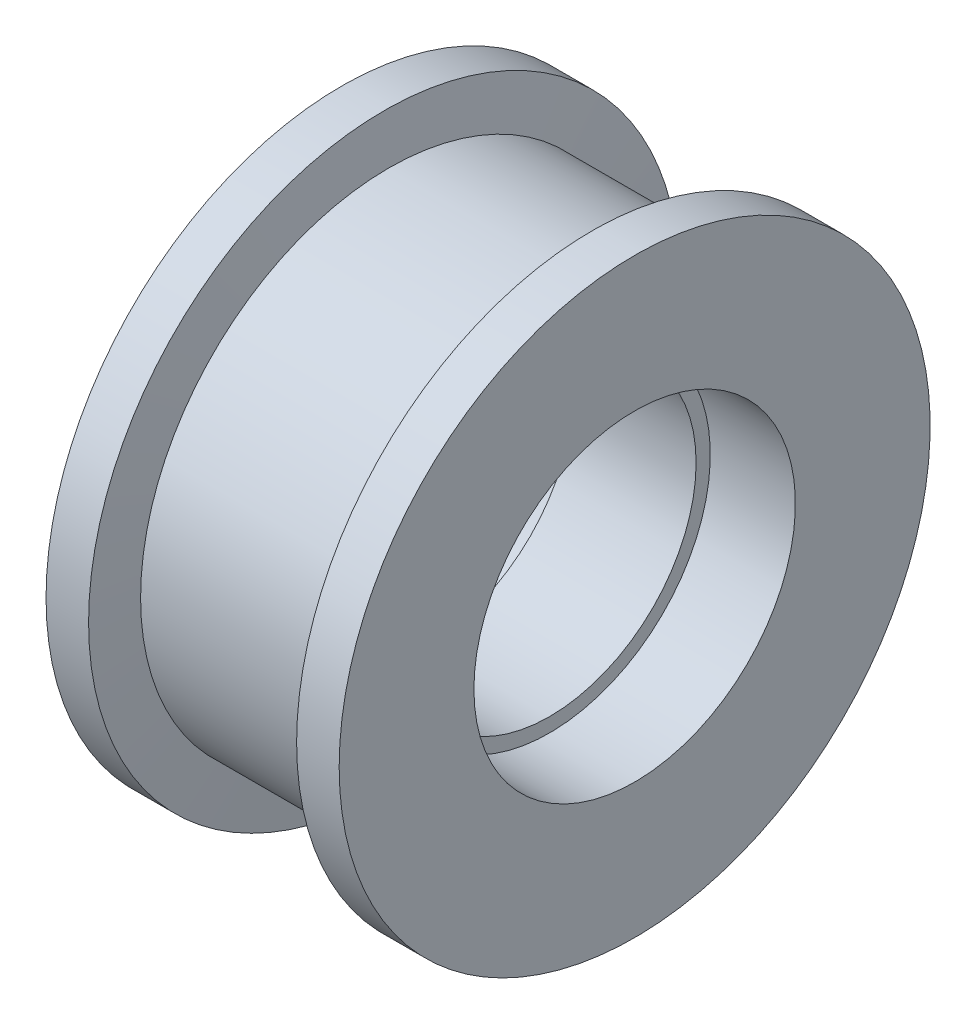
ISO-10303-21;
HEADER;
FILE_DESCRIPTION(('STEP AP214'),'2;1');
FILE_NAME('part.step','',(''),(''),'','','');
FILE_SCHEMA(('AUTOMOTIVE_DESIGN { 1 0 10303 214 1 1 1 1 }'));
ENDSEC;
DATA;
#1=APPLICATION_CONTEXT('core data for automotive mechanical design processes');
#2=APPLICATION_PROTOCOL_DEFINITION('international standard','automotive_design',2000,#1);
#3=PRODUCT_CONTEXT('',#1,'mechanical');
#4=PRODUCT('Part','Part','',(#3));
#5=PRODUCT_RELATED_PRODUCT_CATEGORY('part','',(#4));
#6=PRODUCT_DEFINITION_FORMATION('','',#4);
#7=PRODUCT_DEFINITION_CONTEXT('part definition',#1,'design');
#8=PRODUCT_DEFINITION('design','',#6,#7);
#9=PRODUCT_DEFINITION_SHAPE('','',#8);
#10=(LENGTH_UNIT() NAMED_UNIT(*) SI_UNIT(.MILLI.,.METRE.));
#11=(NAMED_UNIT(*) PLANE_ANGLE_UNIT() SI_UNIT($,.RADIAN.));
#12=(NAMED_UNIT(*) SI_UNIT($,.STERADIAN.) SOLID_ANGLE_UNIT());
#13=UNCERTAINTY_MEASURE_WITH_UNIT(LENGTH_MEASURE(1.E-05),#10,'distance_accuracy_value','');
#14=(GEOMETRIC_REPRESENTATION_CONTEXT(3) GLOBAL_UNCERTAINTY_ASSIGNED_CONTEXT((#13)) GLOBAL_UNIT_ASSIGNED_CONTEXT((#10,
#11,#12)) REPRESENTATION_CONTEXT('',''));
#15=CARTESIAN_POINT('',(0.,0.,0.));
#16=DIRECTION('',(0.,0.,1.));
#17=DIRECTION('',(1.,0.,0.));
#18=AXIS2_PLACEMENT_3D('',#15,#16,#17);
#19=CARTESIAN_POINT('',(-4202.91524097881,0.,7445.48323822232));
#20=DIRECTION('',(-1.,0.,0.));
#21=DIRECTION('',(0.,0.,1.));
#22=AXIS2_PLACEMENT_3D('',#19,#20,#21);
#23=PLANE('',#22);
#24=CARTESIAN_POINT('',(-4202.91524097881,0.,7411.48323822232));
#25=DIRECTION('',(-1.,0.,0.));
#26=DIRECTION('',(0.,0.,1.));
#27=AXIS2_PLACEMENT_3D('',#24,#25,#26);
#28=CIRCLE('',#27,62.5);
#29=CARTESIAN_POINT('',(-4202.91524097881,0.,7473.98323822232));
#30=VERTEX_POINT('',#29);
#31=EDGE_CURVE('E10',#30,#30,#28,.T.);
#32=ORIENTED_EDGE('',*,*,#31,.T.);
#33=EDGE_LOOP('',(#32));
#34=FACE_BOUND('',#33,.T.);
#35=CARTESIAN_POINT('',(-4202.91524097881,0.,7411.48323822232));
#36=DIRECTION('',(-1.,0.,0.));
#37=DIRECTION('',(0.,0.,1.));
#38=AXIS2_PLACEMENT_3D('',#35,#36,#37);
#39=CIRCLE('',#38,33.9999999999998);
#40=CARTESIAN_POINT('',(-4202.91524097881,0.,7445.48323822232));
#41=VERTEX_POINT('',#40);
#42=EDGE_CURVE('E72',#41,#41,#39,.T.);
#43=ORIENTED_EDGE('',*,*,#42,.F.);
#44=EDGE_LOOP('',(#43));
#45=FACE_BOUND('',#44,.T.);
#46=ADVANCED_FACE('F32',(#34,#45),#23,.T.);
#47=CARTESIAN_POINT('',(-4235.17838032797,0.,7411.48323822232));
#48=DIRECTION('',(-1.,0.,0.));
#49=DIRECTION('',(0.,0.,1.));
#50=AXIS2_PLACEMENT_3D('',#47,#48,#49);
#51=CYLINDRICAL_SURFACE('',#50,62.5000000000004);
#52=CARTESIAN_POINT('',(-4193.91524097881,0.,7411.48323822232));
#53=DIRECTION('',(-1.,0.,0.));
#54=DIRECTION('',(0.,0.,1.));
#55=AXIS2_PLACEMENT_3D('',#52,#53,#54);
#56=CIRCLE('',#55,62.5000000000009);
#57=CARTESIAN_POINT('',(-4193.91524097881,0.,7473.98323822232));
#58=VERTEX_POINT('',#57);
#59=EDGE_CURVE('E38',#58,#58,#56,.T.);
#60=ORIENTED_EDGE('',*,*,#59,.T.);
#61=EDGE_LOOP('',(#60));
#62=FACE_BOUND('',#61,.T.);
#63=ORIENTED_EDGE('',*,*,#31,.F.);
#64=EDGE_LOOP('',(#63));
#65=FACE_BOUND('',#64,.T.);
#66=ADVANCED_FACE('F80',(#62,#65),#51,.T.);
#67=CARTESIAN_POINT('',(-4193.91524097881,0.,7411.48323822232));
#68=DIRECTION('',(-1.,0.,0.));
#69=DIRECTION('',(0.,0.,1.));
#70=AXIS2_PLACEMENT_3D('',#67,#68,#69);
#71=CONICAL_SURFACE('',#70,62.5000000000009,1.4711276743038);
#72=CARTESIAN_POINT('',(-4192.91524097881,0.,7411.48323822232));
#73=DIRECTION('',(-1.,0.,0.));
#74=DIRECTION('',(0.,0.,1.));
#75=AXIS2_PLACEMENT_3D('',#72,#73,#74);
#76=CIRCLE('',#75,52.5000000000002);
#77=CARTESIAN_POINT('',(-4192.91524097881,0.,7463.98323822232));
#78=VERTEX_POINT('',#77);
#79=EDGE_CURVE('E42',#78,#78,#76,.T.);
#80=ORIENTED_EDGE('',*,*,#79,.T.);
#81=EDGE_LOOP('',(#80));
#82=FACE_BOUND('',#81,.T.);
#83=ORIENTED_EDGE('',*,*,#59,.F.);
#84=EDGE_LOOP('',(#83));
#85=FACE_BOUND('',#84,.T.);
#86=ADVANCED_FACE('F84',(#82,#85),#71,.T.);
#87=CARTESIAN_POINT('',(-4235.17838032797,0.,7411.48323822232));
#88=DIRECTION('',(-1.,0.,0.));
#89=DIRECTION('',(0.,0.,1.));
#90=AXIS2_PLACEMENT_3D('',#87,#88,#89);
#91=CYLINDRICAL_SURFACE('',#90,52.5000000000007);
#92=CARTESIAN_POINT('',(-4150.91524097881,0.,7411.48323822232));
#93=DIRECTION('',(-1.,0.,0.));
#94=DIRECTION('',(0.,0.,1.));
#95=AXIS2_PLACEMENT_3D('',#92,#93,#94);
#96=CIRCLE('',#95,52.5000000000011);
#97=CARTESIAN_POINT('',(-4150.91524097881,0.,7463.98323822232));
#98=VERTEX_POINT('',#97);
#99=EDGE_CURVE('E46',#98,#98,#96,.T.);
#100=ORIENTED_EDGE('',*,*,#99,.T.);
#101=EDGE_LOOP('',(#100));
#102=FACE_BOUND('',#101,.T.);
#103=ORIENTED_EDGE('',*,*,#79,.F.);
#104=EDGE_LOOP('',(#103));
#105=FACE_BOUND('',#104,.T.);
#106=ADVANCED_FACE('F88',(#102,#105),#91,.T.);
#107=CARTESIAN_POINT('',(-4150.91524097881,0.,7411.48323822232));
#108=DIRECTION('',(1.,0.,0.));
#109=DIRECTION('',(0.,0.,-1.));
#110=AXIS2_PLACEMENT_3D('',#107,#108,#109);
#111=CONICAL_SURFACE('',#110,52.5000000000011,1.47112767430379);
#112=CARTESIAN_POINT('',(-4149.91524097881,0.,7411.48323822232));
#113=DIRECTION('',(-1.,0.,0.));
#114=DIRECTION('',(0.,0.,1.));
#115=AXIS2_PLACEMENT_3D('',#112,#113,#114);
#116=CIRCLE('',#115,62.5000000000009);
#117=CARTESIAN_POINT('',(-4149.91524097881,0.,7473.98323822232));
#118=VERTEX_POINT('',#117);
#119=EDGE_CURVE('E51',#118,#118,#116,.T.);
#120=ORIENTED_EDGE('',*,*,#119,.T.);
#121=EDGE_LOOP('',(#120));
#122=FACE_BOUND('',#121,.T.);
#123=ORIENTED_EDGE('',*,*,#99,.F.);
#124=EDGE_LOOP('',(#123));
#125=FACE_BOUND('',#124,.T.);
#126=ADVANCED_FACE('F95',(#122,#125),#111,.T.);
#127=CARTESIAN_POINT('',(-4235.17838032797,0.,7411.48323822232));
#128=DIRECTION('',(-1.,0.,0.));
#129=DIRECTION('',(0.,0.,1.));
#130=AXIS2_PLACEMENT_3D('',#127,#128,#129);
#131=CYLINDRICAL_SURFACE('',#130,62.5000000000004);
#132=CARTESIAN_POINT('',(-4140.91524097881,0.,7411.48323822232));
#133=DIRECTION('',(-1.,0.,0.));
#134=DIRECTION('',(0.,0.,1.));
#135=AXIS2_PLACEMENT_3D('',#132,#133,#134);
#136=CIRCLE('',#135,62.5);
#137=CARTESIAN_POINT('',(-4140.91524097881,0.,7473.98323822232));
#138=VERTEX_POINT('',#137);
#139=EDGE_CURVE('E54',#138,#138,#136,.T.);
#140=ORIENTED_EDGE('',*,*,#139,.T.);
#141=EDGE_LOOP('',(#140));
#142=FACE_BOUND('',#141,.T.);
#143=ORIENTED_EDGE('',*,*,#119,.F.);
#144=EDGE_LOOP('',(#143));
#145=FACE_BOUND('',#144,.T.);
#146=ADVANCED_FACE('F99',(#142,#145),#131,.T.);
#147=CARTESIAN_POINT('',(-4140.91524097881,0.,7473.98323822232));
#148=DIRECTION('',(1.,0.,0.));
#149=DIRECTION('',(0.,0.,-1.));
#150=AXIS2_PLACEMENT_3D('',#147,#148,#149);
#151=PLANE('',#150);
#152=CARTESIAN_POINT('',(-4140.91524097881,0.,7411.48323822232));
#153=DIRECTION('',(-1.,0.,0.));
#154=DIRECTION('',(0.,0.,1.));
#155=AXIS2_PLACEMENT_3D('',#152,#153,#154);
#156=CIRCLE('',#155,33.9999999999998);
#157=CARTESIAN_POINT('',(-4140.91524097881,0.,7445.48323822232));
#158=VERTEX_POINT('',#157);
#159=EDGE_CURVE('E57',#158,#158,#156,.T.);
#160=ORIENTED_EDGE('',*,*,#159,.T.);
#161=EDGE_LOOP('',(#160));
#162=FACE_BOUND('',#161,.T.);
#163=ORIENTED_EDGE('',*,*,#139,.F.);
#164=EDGE_LOOP('',(#163));
#165=FACE_BOUND('',#164,.T.);
#166=ADVANCED_FACE('F103',(#162,#165),#151,.T.);
#167=CARTESIAN_POINT('',(-4235.17838032797,0.,7411.48323822232));
#168=DIRECTION('',(-1.,0.,0.));
#169=DIRECTION('',(0.,0.,1.));
#170=AXIS2_PLACEMENT_3D('',#167,#168,#169);
#171=CYLINDRICAL_SURFACE('',#170,33.9999999999994);
#172=CARTESIAN_POINT('',(-4158.91524097881,0.,7411.48323822232));
#173=DIRECTION('',(-1.,0.,0.));
#174=DIRECTION('',(0.,0.,1.));
#175=AXIS2_PLACEMENT_3D('',#172,#173,#174);
#176=CIRCLE('',#175,33.9999999999989);
#177=CARTESIAN_POINT('',(-4158.91524097881,0.,7445.48323822232));
#178=VERTEX_POINT('',#177);
#179=EDGE_CURVE('E60',#178,#178,#176,.T.);
#180=ORIENTED_EDGE('',*,*,#179,.T.);
#181=EDGE_LOOP('',(#180));
#182=FACE_BOUND('',#181,.T.);
#183=ORIENTED_EDGE('',*,*,#159,.F.);
#184=EDGE_LOOP('',(#183));
#185=FACE_BOUND('',#184,.T.);
#186=ADVANCED_FACE('F107',(#182,#185),#171,.F.);
#187=CARTESIAN_POINT('',(-4158.91524097881,0.,7445.48323822232));
#188=DIRECTION('',(1.,0.,0.));
#189=DIRECTION('',(0.,0.,-1.));
#190=AXIS2_PLACEMENT_3D('',#187,#188,#189);
#191=PLANE('',#190);
#192=CARTESIAN_POINT('',(-4158.91524097881,0.,7411.48323822232));
#193=DIRECTION('',(-1.,0.,0.));
#194=DIRECTION('',(0.,0.,1.));
#195=AXIS2_PLACEMENT_3D('',#192,#193,#194);
#196=CIRCLE('',#195,30.9999999999997);
#197=CARTESIAN_POINT('',(-4158.91524097881,0.,7442.48323822232));
#198=VERTEX_POINT('',#197);
#199=EDGE_CURVE('E63',#198,#198,#196,.T.);
#200=ORIENTED_EDGE('',*,*,#199,.T.);
#201=EDGE_LOOP('',(#200));
#202=FACE_BOUND('',#201,.T.);
#203=ORIENTED_EDGE('',*,*,#179,.F.);
#204=EDGE_LOOP('',(#203));
#205=FACE_BOUND('',#204,.T.);
#206=ADVANCED_FACE('F111',(#202,#205),#191,.T.);
#207=CARTESIAN_POINT('',(-4235.17838032797,0.,7411.48323822232));
#208=DIRECTION('',(-1.,0.,0.));
#209=DIRECTION('',(0.,0.,1.));
#210=AXIS2_PLACEMENT_3D('',#207,#208,#209);
#211=CYLINDRICAL_SURFACE('',#210,30.9999999999997);
#212=CARTESIAN_POINT('',(-4184.91524097881,0.,7411.48323822232));
#213=DIRECTION('',(-1.,0.,0.));
#214=DIRECTION('',(0.,0.,1.));
#215=AXIS2_PLACEMENT_3D('',#212,#213,#214);
#216=CIRCLE('',#215,30.9999999999997);
#217=CARTESIAN_POINT('',(-4184.91524097881,0.,7442.48323822232));
#218=VERTEX_POINT('',#217);
#219=EDGE_CURVE('E66',#218,#218,#216,.T.);
#220=ORIENTED_EDGE('',*,*,#219,.T.);
#221=EDGE_LOOP('',(#220));
#222=FACE_BOUND('',#221,.T.);
#223=ORIENTED_EDGE('',*,*,#199,.F.);
#224=EDGE_LOOP('',(#223));
#225=FACE_BOUND('',#224,.T.);
#226=ADVANCED_FACE('F115',(#222,#225),#211,.F.);
#227=CARTESIAN_POINT('',(-4184.91524097881,0.,7442.48323822232));
#228=DIRECTION('',(-1.,0.,0.));
#229=DIRECTION('',(0.,0.,1.));
#230=AXIS2_PLACEMENT_3D('',#227,#228,#229);
#231=PLANE('',#230);
#232=CARTESIAN_POINT('',(-4184.91524097881,0.,7411.48323822232));
#233=DIRECTION('',(-1.,0.,0.));
#234=DIRECTION('',(0.,0.,1.));
#235=AXIS2_PLACEMENT_3D('',#232,#233,#234);
#236=CIRCLE('',#235,33.9999999999998);
#237=CARTESIAN_POINT('',(-4184.91524097881,0.,7445.48323822232));
#238=VERTEX_POINT('',#237);
#239=EDGE_CURVE('E69',#238,#238,#236,.T.);
#240=ORIENTED_EDGE('',*,*,#239,.T.);
#241=EDGE_LOOP('',(#240));
#242=FACE_BOUND('',#241,.T.);
#243=ORIENTED_EDGE('',*,*,#219,.F.);
#244=EDGE_LOOP('',(#243));
#245=FACE_BOUND('',#244,.T.);
#246=ADVANCED_FACE('F119',(#242,#245),#231,.T.);
#247=CARTESIAN_POINT('',(-4235.17838032797,0.,7411.48323822232));
#248=DIRECTION('',(-1.,0.,0.));
#249=DIRECTION('',(0.,0.,1.));
#250=AXIS2_PLACEMENT_3D('',#247,#248,#249);
#251=CYLINDRICAL_SURFACE('',#250,33.9999999999998);
#252=ORIENTED_EDGE('',*,*,#42,.T.);
#253=EDGE_LOOP('',(#252));
#254=FACE_BOUND('',#253,.T.);
#255=ORIENTED_EDGE('',*,*,#239,.F.);
#256=EDGE_LOOP('',(#255));
#257=FACE_BOUND('',#256,.T.);
#258=ADVANCED_FACE('F76',(#254,#257),#251,.F.);
#259=CLOSED_SHELL('',(#46,#66,#86,#106,#126,#146,#166,#186,#206,#226,#246,#258));
#260=MANIFOLD_SOLID_BREP('B2',#259);
#261=ADVANCED_BREP_SHAPE_REPRESENTATION('',(#18,#260),#14);
#262=SHAPE_DEFINITION_REPRESENTATION(#9,#261);
ENDSEC;
END-ISO-10303-21;
